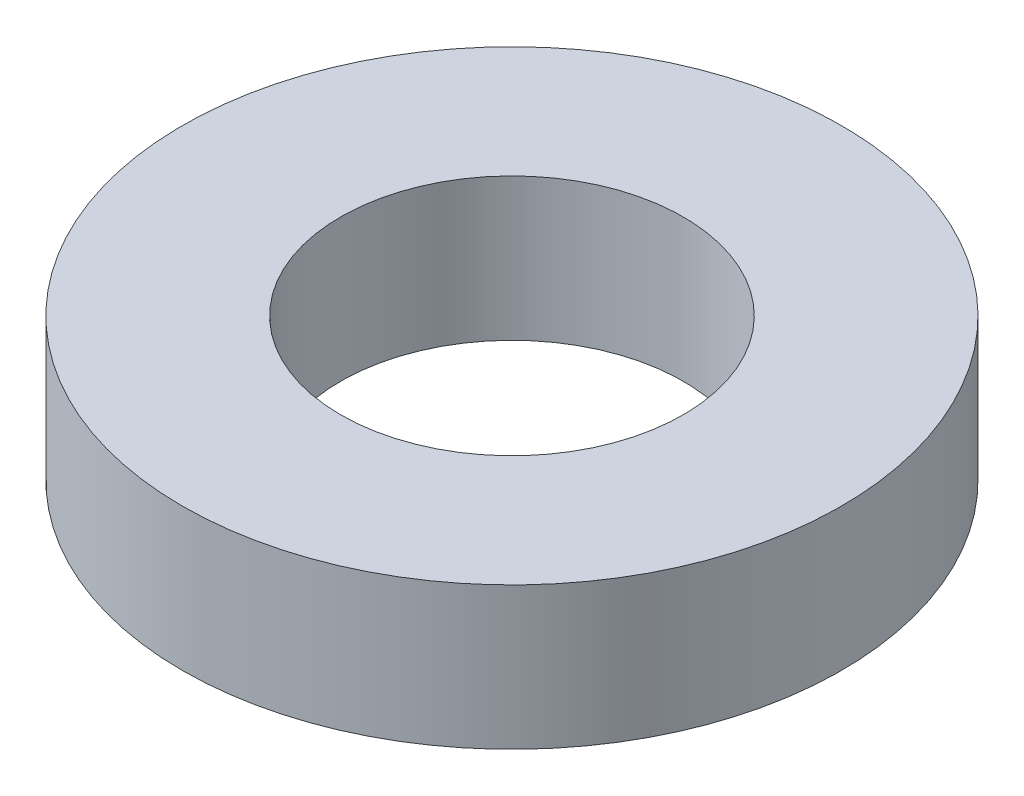
ISO-10303-21;
HEADER;
FILE_DESCRIPTION(('STEP AP214'),'2;1');
FILE_NAME('part.step','',(''),(''),'','','');
FILE_SCHEMA(('AUTOMOTIVE_DESIGN { 1 0 10303 214 1 1 1 1 }'));
ENDSEC;
DATA;
#1=APPLICATION_CONTEXT('core data for automotive mechanical design processes');
#2=APPLICATION_PROTOCOL_DEFINITION('international standard','automotive_design',2000,#1);
#3=PRODUCT_CONTEXT('',#1,'mechanical');
#4=PRODUCT('Part','Part','',(#3));
#5=PRODUCT_RELATED_PRODUCT_CATEGORY('part','',(#4));
#6=PRODUCT_DEFINITION_FORMATION('','',#4);
#7=PRODUCT_DEFINITION_CONTEXT('part definition',#1,'design');
#8=PRODUCT_DEFINITION('design','',#6,#7);
#9=PRODUCT_DEFINITION_SHAPE('','',#8);
#10=(LENGTH_UNIT() NAMED_UNIT(*) SI_UNIT(.MILLI.,.METRE.));
#11=(NAMED_UNIT(*) PLANE_ANGLE_UNIT() SI_UNIT($,.RADIAN.));
#12=(NAMED_UNIT(*) SI_UNIT($,.STERADIAN.) SOLID_ANGLE_UNIT());
#13=UNCERTAINTY_MEASURE_WITH_UNIT(LENGTH_MEASURE(1.E-05),#10,'distance_accuracy_value','');
#14=(GEOMETRIC_REPRESENTATION_CONTEXT(3) GLOBAL_UNCERTAINTY_ASSIGNED_CONTEXT((#13)) GLOBAL_UNIT_ASSIGNED_CONTEXT((#10,
#11,#12)) REPRESENTATION_CONTEXT('',''));
#15=CARTESIAN_POINT('',(0.,0.,0.));
#16=DIRECTION('',(0.,0.,1.));
#17=DIRECTION('',(1.,0.,0.));
#18=AXIS2_PLACEMENT_3D('',#15,#16,#17);
#19=CARTESIAN_POINT('',(0.,27.,0.));
#20=DIRECTION('',(0.,-1.,0.));
#21=DIRECTION('',(0.,0.,-1.));
#22=AXIS2_PLACEMENT_3D('',#19,#20,#21);
#23=CYLINDRICAL_SURFACE('',#22,62.5);
#24=CARTESIAN_POINT('',(0.,27.,0.));
#25=DIRECTION('',(0.,1.,0.));
#26=DIRECTION('',(0.,0.,1.));
#27=AXIS2_PLACEMENT_3D('',#24,#25,#26);
#28=CIRCLE('',#27,62.5);
#29=CARTESIAN_POINT('',(0.,27.,62.5));
#30=VERTEX_POINT('',#29);
#31=EDGE_CURVE('E10',#30,#30,#28,.T.);
#32=ORIENTED_EDGE('',*,*,#31,.F.);
#33=EDGE_LOOP('',(#32));
#34=FACE_BOUND('',#33,.T.);
#35=CARTESIAN_POINT('',(0.,0.,0.));
#36=DIRECTION('',(0.,1.,0.));
#37=DIRECTION('',(0.,0.,1.));
#38=AXIS2_PLACEMENT_3D('',#35,#36,#37);
#39=CIRCLE('',#38,62.5);
#40=CARTESIAN_POINT('',(0.,0.,62.5));
#41=VERTEX_POINT('',#40);
#42=EDGE_CURVE('E37',#41,#41,#39,.T.);
#43=ORIENTED_EDGE('',*,*,#42,.T.);
#44=EDGE_LOOP('',(#43));
#45=FACE_BOUND('',#44,.T.);
#46=ADVANCED_FACE('F40',(#34,#45),#23,.T.);
#47=CARTESIAN_POINT('',(0.,27.,0.));
#48=DIRECTION('',(0.,1.,0.));
#49=DIRECTION('',(0.,0.,1.));
#50=AXIS2_PLACEMENT_3D('',#47,#48,#49);
#51=PLANE('',#50);
#52=CARTESIAN_POINT('',(0.,27.,0.));
#53=DIRECTION('',(0.,1.,0.));
#54=DIRECTION('',(0.,0.,1.));
#55=AXIS2_PLACEMENT_3D('',#52,#53,#54);
#56=CIRCLE('',#55,32.5);
#57=CARTESIAN_POINT('',(0.,27.,32.5));
#58=VERTEX_POINT('',#57);
#59=EDGE_CURVE('E50',#58,#58,#56,.T.);
#60=ORIENTED_EDGE('',*,*,#59,.F.);
#61=EDGE_LOOP('',(#60));
#62=FACE_BOUND('',#61,.T.);
#63=ORIENTED_EDGE('',*,*,#31,.T.);
#64=EDGE_LOOP('',(#63));
#65=FACE_BOUND('',#64,.T.);
#66=ADVANCED_FACE('F59',(#62,#65),#51,.T.);
#67=CARTESIAN_POINT('',(0.,0.,0.));
#68=DIRECTION('',(0.,1.,0.));
#69=DIRECTION('',(0.,0.,1.));
#70=AXIS2_PLACEMENT_3D('',#67,#68,#69);
#71=PLANE('',#70);
#72=CARTESIAN_POINT('',(0.,0.,0.));
#73=DIRECTION('',(0.,1.,0.));
#74=DIRECTION('',(0.,0.,1.));
#75=AXIS2_PLACEMENT_3D('',#72,#73,#74);
#76=CIRCLE('',#75,32.5);
#77=CARTESIAN_POINT('',(0.,0.,32.5));
#78=VERTEX_POINT('',#77);
#79=EDGE_CURVE('E47',#78,#78,#76,.T.);
#80=ORIENTED_EDGE('',*,*,#79,.T.);
#81=EDGE_LOOP('',(#80));
#82=FACE_BOUND('',#81,.T.);
#83=ORIENTED_EDGE('',*,*,#42,.F.);
#84=EDGE_LOOP('',(#83));
#85=FACE_BOUND('',#84,.T.);
#86=ADVANCED_FACE('F58',(#82,#85),#71,.F.);
#87=CARTESIAN_POINT('',(0.,27.,0.));
#88=DIRECTION('',(0.,-1.,0.));
#89=DIRECTION('',(0.,0.,-1.));
#90=AXIS2_PLACEMENT_3D('',#87,#88,#89);
#91=CYLINDRICAL_SURFACE('',#90,32.5);
#92=ORIENTED_EDGE('',*,*,#59,.T.);
#93=EDGE_LOOP('',(#92));
#94=FACE_BOUND('',#93,.T.);
#95=ORIENTED_EDGE('',*,*,#79,.F.);
#96=EDGE_LOOP('',(#95));
#97=FACE_BOUND('',#96,.T.);
#98=ADVANCED_FACE('F54',(#94,#97),#91,.F.);
#99=CLOSED_SHELL('',(#46,#66,#86,#98));
#100=MANIFOLD_SOLID_BREP('B2',#99);
#101=ADVANCED_BREP_SHAPE_REPRESENTATION('',(#18,#100),#14);
#102=SHAPE_DEFINITION_REPRESENTATION(#9,#101);
ENDSEC;
END-ISO-10303-21;
